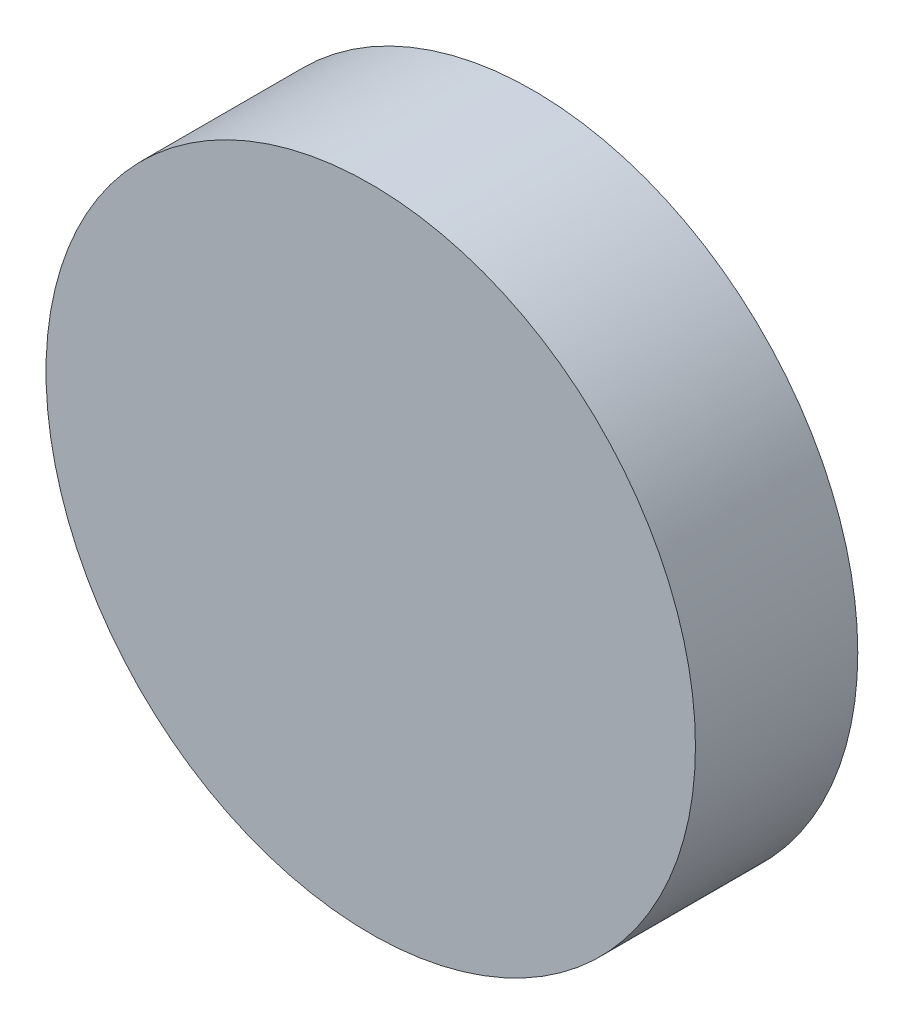
ISO-10303-21;
HEADER;
FILE_DESCRIPTION(('STEP AP214'),'2;1');
FILE_NAME('part.step','',(''),(''),'','','');
FILE_SCHEMA(('AUTOMOTIVE_DESIGN { 1 0 10303 214 1 1 1 1 }'));
ENDSEC;
DATA;
#1=APPLICATION_CONTEXT('core data for automotive mechanical design processes');
#2=APPLICATION_PROTOCOL_DEFINITION('international standard','automotive_design',2000,#1);
#3=PRODUCT_CONTEXT('',#1,'mechanical');
#4=PRODUCT('Part','Part','',(#3));
#5=PRODUCT_RELATED_PRODUCT_CATEGORY('part','',(#4));
#6=PRODUCT_DEFINITION_FORMATION('','',#4);
#7=PRODUCT_DEFINITION_CONTEXT('part definition',#1,'design');
#8=PRODUCT_DEFINITION('design','',#6,#7);
#9=PRODUCT_DEFINITION_SHAPE('','',#8);
#10=(LENGTH_UNIT() NAMED_UNIT(*) SI_UNIT(.MILLI.,.METRE.));
#11=(NAMED_UNIT(*) PLANE_ANGLE_UNIT() SI_UNIT($,.RADIAN.));
#12=(NAMED_UNIT(*) SI_UNIT($,.STERADIAN.) SOLID_ANGLE_UNIT());
#13=UNCERTAINTY_MEASURE_WITH_UNIT(LENGTH_MEASURE(1.E-05),#10,'distance_accuracy_value','');
#14=(GEOMETRIC_REPRESENTATION_CONTEXT(3) GLOBAL_UNCERTAINTY_ASSIGNED_CONTEXT((#13)) GLOBAL_UNIT_ASSIGNED_CONTEXT((#10,
#11,#12)) REPRESENTATION_CONTEXT('',''));
#15=CARTESIAN_POINT('',(0.,0.,0.));
#16=DIRECTION('',(0.,0.,1.));
#17=DIRECTION('',(1.,0.,0.));
#18=AXIS2_PLACEMENT_3D('',#15,#16,#17);
#19=CARTESIAN_POINT('',(0.,0.,5.));
#20=DIRECTION('',(0.,0.,-1.));
#21=DIRECTION('',(-1.,0.,0.));
#22=AXIS2_PLACEMENT_3D('',#19,#20,#21);
#23=CYLINDRICAL_SURFACE('',#22,10.);
#24=CARTESIAN_POINT('',(0.,0.,5.));
#25=DIRECTION('',(0.,0.,1.));
#26=DIRECTION('',(1.,0.,0.));
#27=AXIS2_PLACEMENT_3D('',#24,#25,#26);
#28=CIRCLE('',#27,10.);
#29=CARTESIAN_POINT('',(10.,0.,5.));
#30=VERTEX_POINT('',#29);
#31=EDGE_CURVE('E10',#30,#30,#28,.T.);
#32=ORIENTED_EDGE('',*,*,#31,.F.);
#33=EDGE_LOOP('',(#32));
#34=FACE_BOUND('',#33,.T.);
#35=CARTESIAN_POINT('',(0.,0.,0.));
#36=DIRECTION('',(0.,0.,1.));
#37=DIRECTION('',(1.,0.,0.));
#38=AXIS2_PLACEMENT_3D('',#35,#36,#37);
#39=CIRCLE('',#38,10.);
#40=CARTESIAN_POINT('',(10.,0.,0.));
#41=VERTEX_POINT('',#40);
#42=EDGE_CURVE('E34',#41,#41,#39,.T.);
#43=ORIENTED_EDGE('',*,*,#42,.T.);
#44=EDGE_LOOP('',(#43));
#45=FACE_BOUND('',#44,.T.);
#46=ADVANCED_FACE('F31',(#34,#45),#23,.T.);
#47=CARTESIAN_POINT('',(0.,0.,5.));
#48=DIRECTION('',(0.,0.,1.));
#49=DIRECTION('',(1.,0.,0.));
#50=AXIS2_PLACEMENT_3D('',#47,#48,#49);
#51=PLANE('',#50);
#52=ORIENTED_EDGE('',*,*,#31,.T.);
#53=EDGE_LOOP('',(#52));
#54=FACE_BOUND('',#53,.T.);
#55=ADVANCED_FACE('F61',(#54),#51,.T.);
#56=CARTESIAN_POINT('',(0.,0.,0.));
#57=DIRECTION('',(0.,0.,1.));
#58=DIRECTION('',(1.,0.,0.));
#59=AXIS2_PLACEMENT_3D('',#56,#57,#58);
#60=PLANE('',#59);
#61=CARTESIAN_POINT('',(0.,0.,0.));
#62=DIRECTION('',(0.,0.,1.));
#63=DIRECTION('',(1.,0.,0.));
#64=AXIS2_PLACEMENT_3D('',#61,#62,#63);
#65=CIRCLE('',#64,7.5);
#66=CARTESIAN_POINT('',(7.5,0.,0.));
#67=VERTEX_POINT('',#66);
#68=EDGE_CURVE('E43',#67,#67,#65,.T.);
#69=ORIENTED_EDGE('',*,*,#68,.T.);
#70=EDGE_LOOP('',(#69));
#71=FACE_BOUND('',#70,.T.);
#72=ORIENTED_EDGE('',*,*,#42,.F.);
#73=EDGE_LOOP('',(#72));
#74=FACE_BOUND('',#73,.T.);
#75=ADVANCED_FACE('F58',(#71,#74),#60,.F.);
#76=CARTESIAN_POINT('',(0.,0.,3.));
#77=DIRECTION('',(0.,0.,-1.));
#78=DIRECTION('',(-1.,0.,0.));
#79=AXIS2_PLACEMENT_3D('',#76,#77,#78);
#80=CYLINDRICAL_SURFACE('',#79,7.5);
#81=CARTESIAN_POINT('',(0.,0.,3.));
#82=DIRECTION('',(0.,0.,1.));
#83=DIRECTION('',(1.,0.,0.));
#84=AXIS2_PLACEMENT_3D('',#81,#82,#83);
#85=CIRCLE('',#84,7.5);
#86=CARTESIAN_POINT('',(7.5,0.,3.));
#87=VERTEX_POINT('',#86);
#88=EDGE_CURVE('E41',#87,#87,#85,.T.);
#89=ORIENTED_EDGE('',*,*,#88,.T.);
#90=EDGE_LOOP('',(#89));
#91=FACE_BOUND('',#90,.T.);
#92=ORIENTED_EDGE('',*,*,#68,.F.);
#93=EDGE_LOOP('',(#92));
#94=FACE_BOUND('',#93,.T.);
#95=ADVANCED_FACE('F49',(#91,#94),#80,.F.);
#96=CARTESIAN_POINT('',(0.,0.,3.));
#97=DIRECTION('',(0.,0.,1.));
#98=DIRECTION('',(1.,0.,0.));
#99=AXIS2_PLACEMENT_3D('',#96,#97,#98);
#100=PLANE('',#99);
#101=ORIENTED_EDGE('',*,*,#88,.F.);
#102=EDGE_LOOP('',(#101));
#103=FACE_BOUND('',#102,.T.);
#104=ADVANCED_FACE('F52',(#103),#100,.F.);
#105=CLOSED_SHELL('',(#46,#55,#75,#95,#104));
#106=MANIFOLD_SOLID_BREP('B2',#105);
#107=ADVANCED_BREP_SHAPE_REPRESENTATION('',(#18,#106),#14);
#108=SHAPE_DEFINITION_REPRESENTATION(#9,#107);
ENDSEC;
END-ISO-10303-21;
